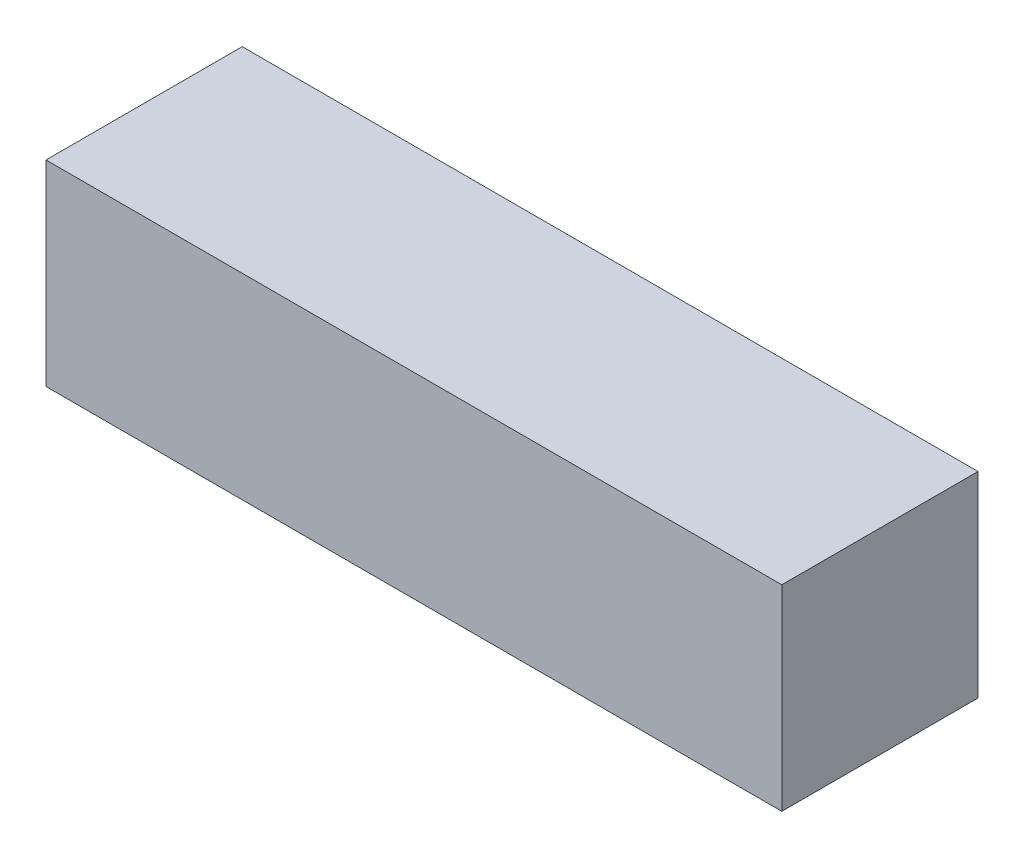
ISO-10303-21;
HEADER;
FILE_DESCRIPTION(('STEP AP214'),'2;1');
FILE_NAME('part.step','',(''),(''),'','','');
FILE_SCHEMA(('AUTOMOTIVE_DESIGN { 1 0 10303 214 1 1 1 1 }'));
ENDSEC;
DATA;
#1=APPLICATION_CONTEXT('core data for automotive mechanical design processes');
#2=APPLICATION_PROTOCOL_DEFINITION('international standard','automotive_design',2000,#1);
#3=PRODUCT_CONTEXT('',#1,'mechanical');
#4=PRODUCT('Part','Part','',(#3));
#5=PRODUCT_RELATED_PRODUCT_CATEGORY('part','',(#4));
#6=PRODUCT_DEFINITION_FORMATION('','',#4);
#7=PRODUCT_DEFINITION_CONTEXT('part definition',#1,'design');
#8=PRODUCT_DEFINITION('design','',#6,#7);
#9=PRODUCT_DEFINITION_SHAPE('','',#8);
#10=(LENGTH_UNIT() NAMED_UNIT(*) SI_UNIT(.MILLI.,.METRE.));
#11=(NAMED_UNIT(*) PLANE_ANGLE_UNIT() SI_UNIT($,.RADIAN.));
#12=(NAMED_UNIT(*) SI_UNIT($,.STERADIAN.) SOLID_ANGLE_UNIT());
#13=UNCERTAINTY_MEASURE_WITH_UNIT(LENGTH_MEASURE(1.E-05),#10,'distance_accuracy_value','');
#14=(GEOMETRIC_REPRESENTATION_CONTEXT(3) GLOBAL_UNCERTAINTY_ASSIGNED_CONTEXT((#13)) GLOBAL_UNIT_ASSIGNED_CONTEXT((#10,
#11,#12)) REPRESENTATION_CONTEXT('',''));
#15=CARTESIAN_POINT('',(0.,0.,0.));
#16=DIRECTION('',(0.,0.,1.));
#17=DIRECTION('',(1.,0.,0.));
#18=AXIS2_PLACEMENT_3D('',#15,#16,#17);
#19=CARTESIAN_POINT('',(-1.5,1.3,0.2));
#20=DIRECTION('',(0.,1.,0.));
#21=DIRECTION('',(0.,0.,1.));
#22=AXIS2_PLACEMENT_3D('',#19,#20,#21);
#23=PLANE('',#22);
#24=DIRECTION('',(-1.,0.,0.));
#25=VECTOR('',#24,1.);
#26=CARTESIAN_POINT('',(-0.75,1.3,0.));
#27=LINE('',#26,#25);
#28=CARTESIAN_POINT('',(-0.75,1.3,0.));
#29=VERTEX_POINT('',#28);
#30=CARTESIAN_POINT('',(-2.25,1.3,0.));
#31=VERTEX_POINT('',#30);
#32=EDGE_CURVE('E68',#29,#31,#27,.T.);
#33=ORIENTED_EDGE('',*,*,#32,.F.);
#34=DIRECTION('',(0.,0.,-1.));
#35=VECTOR('',#34,1.);
#36=CARTESIAN_POINT('',(-0.75,1.3,0.4));
#37=LINE('',#36,#35);
#38=CARTESIAN_POINT('',(-0.75,1.3,0.4));
#39=VERTEX_POINT('',#38);
#40=EDGE_CURVE('E55',#39,#29,#37,.T.);
#41=ORIENTED_EDGE('',*,*,#40,.F.);
#42=DIRECTION('',(1.,0.,0.));
#43=VECTOR('',#42,1.);
#44=CARTESIAN_POINT('',(-2.25,1.3,0.4));
#45=LINE('',#44,#43);
#46=CARTESIAN_POINT('',(-2.25,1.3,0.4));
#47=VERTEX_POINT('',#46);
#48=EDGE_CURVE('E20',#47,#39,#45,.T.);
#49=ORIENTED_EDGE('',*,*,#48,.F.);
#50=DIRECTION('',(0.,0.,1.));
#51=VECTOR('',#50,1.);
#52=CARTESIAN_POINT('',(-2.25,1.3,0.));
#53=LINE('',#52,#51);
#54=EDGE_CURVE('E80',#31,#47,#53,.T.);
#55=ORIENTED_EDGE('',*,*,#54,.F.);
#56=EDGE_LOOP('',(#33,#41,#49,#55));
#57=FACE_BOUND('',#56,.T.);
#58=ADVANCED_FACE('F17',(#57),#23,.F.);
#59=CARTESIAN_POINT('',(-2.25,1.7,0.4));
#60=DIRECTION('',(0.,0.,1.));
#61=DIRECTION('',(1.,0.,0.));
#62=AXIS2_PLACEMENT_3D('',#59,#60,#61);
#63=PLANE('',#62);
#64=DIRECTION('',(0.,1.,0.));
#65=VECTOR('',#64,1.);
#66=CARTESIAN_POINT('',(-0.75,1.7,0.4));
#67=LINE('',#66,#65);
#68=CARTESIAN_POINT('',(-0.75,1.7,0.4));
#69=VERTEX_POINT('',#68);
#70=EDGE_CURVE('E61',#69,#39,#67,.F.);
#71=ORIENTED_EDGE('',*,*,#70,.F.);
#72=DIRECTION('',(1.,0.,0.));
#73=VECTOR('',#72,1.);
#74=CARTESIAN_POINT('',(-1.5,1.7,0.4));
#75=LINE('',#74,#73);
#76=CARTESIAN_POINT('',(-2.25,1.7,0.4));
#77=VERTEX_POINT('',#76);
#78=EDGE_CURVE('E83',#77,#69,#75,.T.);
#79=ORIENTED_EDGE('',*,*,#78,.F.);
#80=DIRECTION('',(0.,1.,0.));
#81=VECTOR('',#80,1.);
#82=CARTESIAN_POINT('',(-2.25,1.7,0.4));
#83=LINE('',#82,#81);
#84=EDGE_CURVE('E64',#47,#77,#83,.T.);
#85=ORIENTED_EDGE('',*,*,#84,.F.);
#86=ORIENTED_EDGE('',*,*,#48,.T.);
#87=EDGE_LOOP('',(#71,#79,#85,#86));
#88=FACE_BOUND('',#87,.T.);
#89=ADVANCED_FACE('F60',(#88),#63,.T.);
#90=CARTESIAN_POINT('',(-0.75,1.7,0.4));
#91=DIRECTION('',(1.,0.,0.));
#92=DIRECTION('',(0.,0.,-1.));
#93=AXIS2_PLACEMENT_3D('',#90,#91,#92);
#94=PLANE('',#93);
#95=DIRECTION('',(0.,1.,0.));
#96=VECTOR('',#95,1.);
#97=CARTESIAN_POINT('',(-0.75,1.7,0.));
#98=LINE('',#97,#96);
#99=CARTESIAN_POINT('',(-0.75,1.7,0.));
#100=VERTEX_POINT('',#99);
#101=EDGE_CURVE('E70',#100,#29,#98,.F.);
#102=ORIENTED_EDGE('',*,*,#101,.F.);
#103=DIRECTION('',(0.,0.,1.));
#104=VECTOR('',#103,1.);
#105=CARTESIAN_POINT('',(-0.75,1.7,0.2));
#106=LINE('',#105,#104);
#107=EDGE_CURVE('E74',#69,#100,#106,.F.);
#108=ORIENTED_EDGE('',*,*,#107,.F.);
#109=ORIENTED_EDGE('',*,*,#70,.T.);
#110=ORIENTED_EDGE('',*,*,#40,.T.);
#111=EDGE_LOOP('',(#102,#108,#109,#110));
#112=FACE_BOUND('',#111,.T.);
#113=ADVANCED_FACE('F72',(#112),#94,.T.);
#114=CARTESIAN_POINT('',(-0.75,1.7,0.));
#115=DIRECTION('',(0.,0.,-1.));
#116=DIRECTION('',(-1.,0.,0.));
#117=AXIS2_PLACEMENT_3D('',#114,#115,#116);
#118=PLANE('',#117);
#119=DIRECTION('',(0.,1.,0.));
#120=VECTOR('',#119,1.);
#121=CARTESIAN_POINT('',(-2.25,1.7,0.));
#122=LINE('',#121,#120);
#123=CARTESIAN_POINT('',(-2.25,1.7,0.));
#124=VERTEX_POINT('',#123);
#125=EDGE_CURVE('E35',#124,#31,#122,.F.);
#126=ORIENTED_EDGE('',*,*,#125,.F.);
#127=DIRECTION('',(1.,0.,0.));
#128=VECTOR('',#127,1.);
#129=CARTESIAN_POINT('',(-1.5,1.7,0.));
#130=LINE('',#129,#128);
#131=EDGE_CURVE('E26',#100,#124,#130,.F.);
#132=ORIENTED_EDGE('',*,*,#131,.F.);
#133=ORIENTED_EDGE('',*,*,#101,.T.);
#134=ORIENTED_EDGE('',*,*,#32,.T.);
#135=EDGE_LOOP('',(#126,#132,#133,#134));
#136=FACE_BOUND('',#135,.T.);
#137=ADVANCED_FACE('F89',(#136),#118,.T.);
#138=CARTESIAN_POINT('',(-2.25,1.7,0.));
#139=DIRECTION('',(-1.,0.,0.));
#140=DIRECTION('',(0.,0.,1.));
#141=AXIS2_PLACEMENT_3D('',#138,#139,#140);
#142=PLANE('',#141);
#143=ORIENTED_EDGE('',*,*,#84,.T.);
#144=DIRECTION('',(0.,0.,1.));
#145=VECTOR('',#144,1.);
#146=CARTESIAN_POINT('',(-2.25,1.7,0.2));
#147=LINE('',#146,#145);
#148=EDGE_CURVE('E11',#124,#77,#147,.T.);
#149=ORIENTED_EDGE('',*,*,#148,.F.);
#150=ORIENTED_EDGE('',*,*,#125,.T.);
#151=ORIENTED_EDGE('',*,*,#54,.T.);
#152=EDGE_LOOP('',(#143,#149,#150,#151));
#153=FACE_BOUND('',#152,.T.);
#154=ADVANCED_FACE('F91',(#153),#142,.T.);
#155=CARTESIAN_POINT('',(-1.5,1.7,0.2));
#156=DIRECTION('',(0.,1.,0.));
#157=DIRECTION('',(0.,0.,1.));
#158=AXIS2_PLACEMENT_3D('',#155,#156,#157);
#159=PLANE('',#158);
#160=ORIENTED_EDGE('',*,*,#131,.T.);
#161=ORIENTED_EDGE('',*,*,#148,.T.);
#162=ORIENTED_EDGE('',*,*,#78,.T.);
#163=ORIENTED_EDGE('',*,*,#107,.T.);
#164=EDGE_LOOP('',(#160,#161,#162,#163));
#165=FACE_BOUND('',#164,.T.);
#166=ADVANCED_FACE('F88',(#165),#159,.T.);
#167=CLOSED_SHELL('',(#58,#89,#113,#137,#154,#166));
#168=MANIFOLD_SOLID_BREP('B1',#167);
#169=ADVANCED_BREP_SHAPE_REPRESENTATION('',(#18,#168),#14);
#170=SHAPE_DEFINITION_REPRESENTATION(#9,#169);
ENDSEC;
END-ISO-10303-21;
